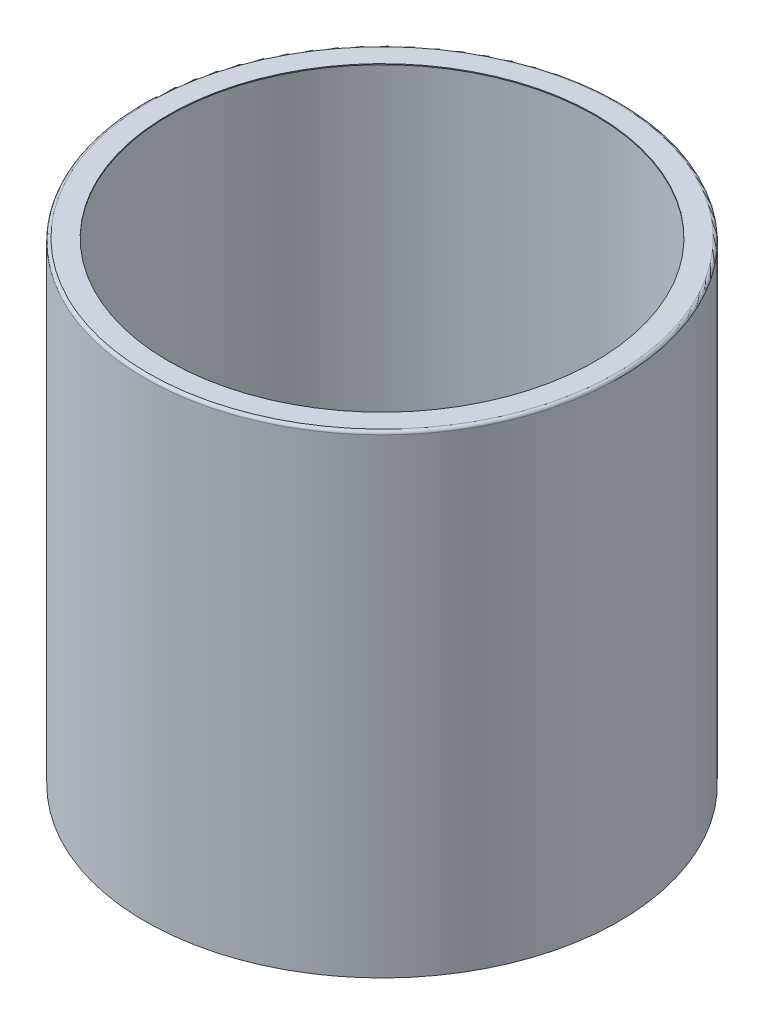
ISO-10303-21;
HEADER;
FILE_DESCRIPTION(('STEP AP214'),'2;1');
FILE_NAME('part.step','',(''),(''),'','','');
FILE_SCHEMA(('AUTOMOTIVE_DESIGN { 1 0 10303 214 1 1 1 1 }'));
ENDSEC;
DATA;
#1=APPLICATION_CONTEXT('core data for automotive mechanical design processes');
#2=APPLICATION_PROTOCOL_DEFINITION('international standard','automotive_design',2000,#1);
#3=PRODUCT_CONTEXT('',#1,'mechanical');
#4=PRODUCT('Part','Part','',(#3));
#5=PRODUCT_RELATED_PRODUCT_CATEGORY('part','',(#4));
#6=PRODUCT_DEFINITION_FORMATION('','',#4);
#7=PRODUCT_DEFINITION_CONTEXT('part definition',#1,'design');
#8=PRODUCT_DEFINITION('design','',#6,#7);
#9=PRODUCT_DEFINITION_SHAPE('','',#8);
#10=(LENGTH_UNIT() NAMED_UNIT(*) SI_UNIT(.MILLI.,.METRE.));
#11=(NAMED_UNIT(*) PLANE_ANGLE_UNIT() SI_UNIT($,.RADIAN.));
#12=(NAMED_UNIT(*) SI_UNIT($,.STERADIAN.) SOLID_ANGLE_UNIT());
#13=UNCERTAINTY_MEASURE_WITH_UNIT(LENGTH_MEASURE(1.E-05),#10,'distance_accuracy_value','');
#14=(GEOMETRIC_REPRESENTATION_CONTEXT(3) GLOBAL_UNCERTAINTY_ASSIGNED_CONTEXT((#13)) GLOBAL_UNIT_ASSIGNED_CONTEXT((#10,
#11,#12)) REPRESENTATION_CONTEXT('',''));
#15=CARTESIAN_POINT('',(0.,0.,0.));
#16=DIRECTION('',(0.,0.,1.));
#17=DIRECTION('',(1.,0.,0.));
#18=AXIS2_PLACEMENT_3D('',#15,#16,#17);
#19=CARTESIAN_POINT('',(0.,0.,0.));
#20=DIRECTION('',(0.,-1.,0.));
#21=DIRECTION('',(0.,0.,-1.));
#22=AXIS2_PLACEMENT_3D('',#19,#20,#21);
#23=CYLINDRICAL_SURFACE('',#22,254.);
#24=CARTESIAN_POINT('',(0.,-254.,0.));
#25=DIRECTION('',(0.,-1.,0.));
#26=DIRECTION('',(0.,0.,-1.));
#27=AXIS2_PLACEMENT_3D('',#24,#25,#26);
#28=CIRCLE('',#27,254.);
#29=CARTESIAN_POINT('',(0.,-254.,-254.));
#30=VERTEX_POINT('',#29);
#31=EDGE_CURVE('E10',#30,#30,#28,.T.);
#32=ORIENTED_EDGE('',*,*,#31,.T.);
#33=EDGE_LOOP('',(#32));
#34=FACE_BOUND('',#33,.T.);
#35=CARTESIAN_POINT('',(0.,250.825,0.));
#36=DIRECTION('',(0.,-1.,0.));
#37=DIRECTION('',(0.,0.,-1.));
#38=AXIS2_PLACEMENT_3D('',#35,#36,#37);
#39=CIRCLE('',#38,254.);
#40=CARTESIAN_POINT('',(0.,250.825,-254.));
#41=VERTEX_POINT('',#40);
#42=EDGE_CURVE('E61',#41,#41,#39,.T.);
#43=ORIENTED_EDGE('',*,*,#42,.F.);
#44=EDGE_LOOP('',(#43));
#45=FACE_BOUND('',#44,.T.);
#46=ADVANCED_FACE('F33',(#34,#45),#23,.F.);
#47=CARTESIAN_POINT('',(0.,-254.,-254.));
#48=DIRECTION('',(0.,-1.,0.));
#49=DIRECTION('',(0.,0.,-1.));
#50=AXIS2_PLACEMENT_3D('',#47,#48,#49);
#51=PLANE('',#50);
#52=CARTESIAN_POINT('',(0.,-254.,0.));
#53=DIRECTION('',(0.,-1.,0.));
#54=DIRECTION('',(0.,0.,-1.));
#55=AXIS2_PLACEMENT_3D('',#52,#53,#54);
#56=CIRCLE('',#55,255.0287);
#57=CARTESIAN_POINT('',(0.,-254.,-255.0287));
#58=VERTEX_POINT('',#57);
#59=EDGE_CURVE('E39',#58,#58,#56,.T.);
#60=ORIENTED_EDGE('',*,*,#59,.T.);
#61=EDGE_LOOP('',(#60));
#62=FACE_BOUND('',#61,.T.);
#63=ORIENTED_EDGE('',*,*,#31,.F.);
#64=EDGE_LOOP('',(#63));
#65=FACE_BOUND('',#64,.T.);
#66=ADVANCED_FACE('F69',(#62,#65),#51,.T.);
#67=CARTESIAN_POINT('',(0.,0.,0.));
#68=DIRECTION('',(0.,-1.,0.));
#69=DIRECTION('',(0.,0.,-1.));
#70=AXIS2_PLACEMENT_3D('',#67,#68,#69);
#71=CYLINDRICAL_SURFACE('',#70,255.0287);
#72=CARTESIAN_POINT('',(0.,251.8537,0.));
#73=DIRECTION('',(0.,-1.,0.));
#74=DIRECTION('',(0.,0.,-1.));
#75=AXIS2_PLACEMENT_3D('',#72,#73,#74);
#76=CIRCLE('',#75,255.0287);
#77=CARTESIAN_POINT('',(0.,251.8537,-255.0287));
#78=VERTEX_POINT('',#77);
#79=EDGE_CURVE('E43',#78,#78,#76,.T.);
#80=ORIENTED_EDGE('',*,*,#79,.T.);
#81=EDGE_LOOP('',(#80));
#82=FACE_BOUND('',#81,.T.);
#83=ORIENTED_EDGE('',*,*,#59,.F.);
#84=EDGE_LOOP('',(#83));
#85=FACE_BOUND('',#84,.T.);
#86=ADVANCED_FACE('F73',(#82,#85),#71,.T.);
#87=CARTESIAN_POINT('',(0.,251.8537,0.));
#88=DIRECTION('',(0.,-1.,0.));
#89=DIRECTION('',(0.,0.,-1.));
#90=AXIS2_PLACEMENT_3D('',#87,#88,#89);
#91=TOROIDAL_SURFACE('',#90,251.8537,3.17499999999998);
#92=CARTESIAN_POINT('',(0.,255.0287,0.));
#93=DIRECTION('',(0.,-1.,0.));
#94=DIRECTION('',(0.,0.,-1.));
#95=AXIS2_PLACEMENT_3D('',#92,#93,#94);
#96=CIRCLE('',#95,251.8537);
#97=CARTESIAN_POINT('',(0.,255.0287,-251.8537));
#98=VERTEX_POINT('',#97);
#99=EDGE_CURVE('E47',#98,#98,#96,.T.);
#100=ORIENTED_EDGE('',*,*,#99,.T.);
#101=EDGE_LOOP('',(#100));
#102=FACE_BOUND('',#101,.T.);
#103=ORIENTED_EDGE('',*,*,#79,.F.);
#104=EDGE_LOOP('',(#103));
#105=FACE_BOUND('',#104,.T.);
#106=ADVANCED_FACE('F77',(#102,#105),#91,.T.);
#107=CARTESIAN_POINT('',(0.,255.0287,-251.8537));
#108=DIRECTION('',(0.,1.,0.));
#109=DIRECTION('',(0.,0.,1.));
#110=AXIS2_PLACEMENT_3D('',#107,#108,#109);
#111=PLANE('',#110);
#112=CARTESIAN_POINT('',(0.,255.0287,0.));
#113=DIRECTION('',(0.,-1.,0.));
#114=DIRECTION('',(0.,0.,-1.));
#115=AXIS2_PLACEMENT_3D('',#112,#113,#114);
#116=CIRCLE('',#115,229.6287);
#117=CARTESIAN_POINT('',(0.,255.0287,-229.6287));
#118=VERTEX_POINT('',#117);
#119=EDGE_CURVE('E52',#118,#118,#116,.T.);
#120=ORIENTED_EDGE('',*,*,#119,.T.);
#121=EDGE_LOOP('',(#120));
#122=FACE_BOUND('',#121,.T.);
#123=ORIENTED_EDGE('',*,*,#99,.F.);
#124=EDGE_LOOP('',(#123));
#125=FACE_BOUND('',#124,.T.);
#126=ADVANCED_FACE('F84',(#122,#125),#111,.T.);
#127=CARTESIAN_POINT('',(0.,0.,0.));
#128=DIRECTION('',(0.,-1.,0.));
#129=DIRECTION('',(0.,0.,-1.));
#130=AXIS2_PLACEMENT_3D('',#127,#128,#129);
#131=CYLINDRICAL_SURFACE('',#130,229.6287);
#132=CARTESIAN_POINT('',(0.,254.,0.));
#133=DIRECTION('',(0.,-1.,0.));
#134=DIRECTION('',(0.,0.,-1.));
#135=AXIS2_PLACEMENT_3D('',#132,#133,#134);
#136=CIRCLE('',#135,229.6287);
#137=CARTESIAN_POINT('',(0.,254.,-229.6287));
#138=VERTEX_POINT('',#137);
#139=EDGE_CURVE('E55',#138,#138,#136,.T.);
#140=ORIENTED_EDGE('',*,*,#139,.T.);
#141=EDGE_LOOP('',(#140));
#142=FACE_BOUND('',#141,.T.);
#143=ORIENTED_EDGE('',*,*,#119,.F.);
#144=EDGE_LOOP('',(#143));
#145=FACE_BOUND('',#144,.T.);
#146=ADVANCED_FACE('F88',(#142,#145),#131,.F.);
#147=CARTESIAN_POINT('',(0.,254.,-229.6287));
#148=DIRECTION('',(0.,-1.,0.));
#149=DIRECTION('',(0.,0.,-1.));
#150=AXIS2_PLACEMENT_3D('',#147,#148,#149);
#151=PLANE('',#150);
#152=CARTESIAN_POINT('',(0.,254.,0.));
#153=DIRECTION('',(0.,-1.,0.));
#154=DIRECTION('',(0.,0.,-1.));
#155=AXIS2_PLACEMENT_3D('',#152,#153,#154);
#156=CIRCLE('',#155,250.825);
#157=CARTESIAN_POINT('',(0.,254.,-250.825));
#158=VERTEX_POINT('',#157);
#159=EDGE_CURVE('E58',#158,#158,#156,.T.);
#160=ORIENTED_EDGE('',*,*,#159,.T.);
#161=EDGE_LOOP('',(#160));
#162=FACE_BOUND('',#161,.T.);
#163=ORIENTED_EDGE('',*,*,#139,.F.);
#164=EDGE_LOOP('',(#163));
#165=FACE_BOUND('',#164,.T.);
#166=ADVANCED_FACE('F92',(#162,#165),#151,.T.);
#167=CARTESIAN_POINT('',(0.,250.825,0.));
#168=DIRECTION('',(0.,-1.,0.));
#169=DIRECTION('',(0.,0.,-1.));
#170=AXIS2_PLACEMENT_3D('',#167,#168,#169);
#171=TOROIDAL_SURFACE('',#170,250.825,3.17499999999998);
#172=ORIENTED_EDGE('',*,*,#42,.T.);
#173=EDGE_LOOP('',(#172));
#174=FACE_BOUND('',#173,.T.);
#175=ORIENTED_EDGE('',*,*,#159,.F.);
#176=EDGE_LOOP('',(#175));
#177=FACE_BOUND('',#176,.T.);
#178=ADVANCED_FACE('F65',(#174,#177),#171,.F.);
#179=CLOSED_SHELL('',(#46,#66,#86,#106,#126,#146,#166,#178));
#180=MANIFOLD_SOLID_BREP('B2',#179);
#181=ADVANCED_BREP_SHAPE_REPRESENTATION('',(#18,#180),#14);
#182=SHAPE_DEFINITION_REPRESENTATION(#9,#181);
ENDSEC;
END-ISO-10303-21;
